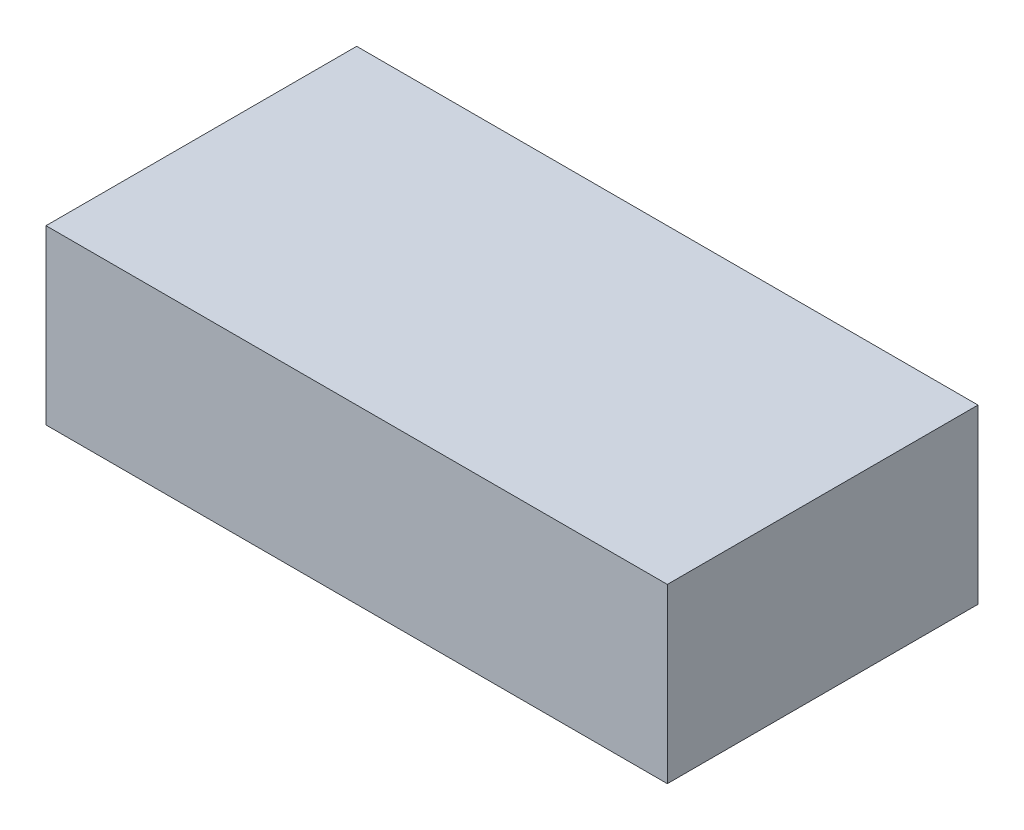
ISO-10303-21;
HEADER;
FILE_DESCRIPTION(('STEP AP214'),'2;1');
FILE_NAME('part.step','',(''),(''),'','','');
FILE_SCHEMA(('AUTOMOTIVE_DESIGN { 1 0 10303 214 1 1 1 1 }'));
ENDSEC;
DATA;
#1=APPLICATION_CONTEXT('core data for automotive mechanical design processes');
#2=APPLICATION_PROTOCOL_DEFINITION('international standard','automotive_design',2000,#1);
#3=PRODUCT_CONTEXT('',#1,'mechanical');
#4=PRODUCT('Part','Part','',(#3));
#5=PRODUCT_RELATED_PRODUCT_CATEGORY('part','',(#4));
#6=PRODUCT_DEFINITION_FORMATION('','',#4);
#7=PRODUCT_DEFINITION_CONTEXT('part definition',#1,'design');
#8=PRODUCT_DEFINITION('design','',#6,#7);
#9=PRODUCT_DEFINITION_SHAPE('','',#8);
#10=(LENGTH_UNIT() NAMED_UNIT(*) SI_UNIT(.MILLI.,.METRE.));
#11=(NAMED_UNIT(*) PLANE_ANGLE_UNIT() SI_UNIT($,.RADIAN.));
#12=(NAMED_UNIT(*) SI_UNIT($,.STERADIAN.) SOLID_ANGLE_UNIT());
#13=UNCERTAINTY_MEASURE_WITH_UNIT(LENGTH_MEASURE(1.E-05),#10,'distance_accuracy_value','');
#14=(GEOMETRIC_REPRESENTATION_CONTEXT(3) GLOBAL_UNCERTAINTY_ASSIGNED_CONTEXT((#13)) GLOBAL_UNIT_ASSIGNED_CONTEXT((#10,
#11,#12)) REPRESENTATION_CONTEXT('',''));
#15=CARTESIAN_POINT('',(0.,0.,0.));
#16=DIRECTION('',(0.,0.,1.));
#17=DIRECTION('',(1.,0.,0.));
#18=AXIS2_PLACEMENT_3D('',#15,#16,#17);
#19=CARTESIAN_POINT('',(-114.3,63.5,57.15));
#20=DIRECTION('',(-1.,0.,0.));
#21=DIRECTION('',(0.,0.,1.));
#22=AXIS2_PLACEMENT_3D('',#19,#20,#21);
#23=PLANE('',#22);
#24=CARTESIAN_POINT('',(-114.3,57.15,-38.1));
#25=DIRECTION('',(-1.,0.,0.));
#26=DIRECTION('',(0.,0.,1.));
#27=AXIS2_PLACEMENT_3D('',#24,#25,#26);
#28=CIRCLE('',#27,1.5875);
#29=CARTESIAN_POINT('',(-114.3,57.15,-36.5125));
#30=VERTEX_POINT('',#29);
#31=EDGE_CURVE('E145',#30,#30,#28,.T.);
#32=ORIENTED_EDGE('',*,*,#31,.F.);
#33=EDGE_LOOP('',(#32));
#34=FACE_BOUND('',#33,.T.);
#35=CARTESIAN_POINT('',(-114.3,57.15,38.1));
#36=DIRECTION('',(-1.,0.,0.));
#37=DIRECTION('',(0.,0.,1.));
#38=AXIS2_PLACEMENT_3D('',#35,#36,#37);
#39=CIRCLE('',#38,1.5875);
#40=CARTESIAN_POINT('',(-114.3,57.15,39.6875));
#41=VERTEX_POINT('',#40);
#42=EDGE_CURVE('E148',#41,#41,#39,.T.);
#43=ORIENTED_EDGE('',*,*,#42,.F.);
#44=EDGE_LOOP('',(#43));
#45=FACE_BOUND('',#44,.T.);
#46=DIRECTION('',(0.,0.,-1.));
#47=VECTOR('',#46,1.);
#48=CARTESIAN_POINT('',(-114.3,0.,57.15));
#49=LINE('',#48,#47);
#50=CARTESIAN_POINT('',(-114.3,0.,57.15));
#51=VERTEX_POINT('',#50);
#52=CARTESIAN_POINT('',(-114.3,0.,-57.15));
#53=VERTEX_POINT('',#52);
#54=EDGE_CURVE('E117',#51,#53,#49,.T.);
#55=ORIENTED_EDGE('',*,*,#54,.F.);
#56=DIRECTION('',(0.,-1.,0.));
#57=VECTOR('',#56,1.);
#58=CARTESIAN_POINT('',(-114.3,63.5,57.15));
#59=LINE('',#58,#57);
#60=CARTESIAN_POINT('',(-114.3,63.5,57.15));
#61=VERTEX_POINT('',#60);
#62=EDGE_CURVE('E11',#61,#51,#59,.T.);
#63=ORIENTED_EDGE('',*,*,#62,.F.);
#64=DIRECTION('',(0.,0.,-1.));
#65=VECTOR('',#64,1.);
#66=CARTESIAN_POINT('',(-114.3,63.5,57.15));
#67=LINE('',#66,#65);
#68=CARTESIAN_POINT('',(-114.3,63.5,-57.15));
#69=VERTEX_POINT('',#68);
#70=EDGE_CURVE('E109',#61,#69,#67,.T.);
#71=ORIENTED_EDGE('',*,*,#70,.T.);
#72=DIRECTION('',(0.,-1.,0.));
#73=VECTOR('',#72,1.);
#74=CARTESIAN_POINT('',(-114.3,63.5,-57.15));
#75=LINE('',#74,#73);
#76=EDGE_CURVE('E48',#69,#53,#75,.T.);
#77=ORIENTED_EDGE('',*,*,#76,.T.);
#78=EDGE_LOOP('',(#55,#63,#71,#77));
#79=FACE_BOUND('',#78,.T.);
#80=ADVANCED_FACE('F45',(#34,#45,#79),#23,.T.);
#81=CARTESIAN_POINT('',(-114.3,63.5,57.15));
#82=DIRECTION('',(0.,0.,-1.));
#83=DIRECTION('',(-1.,0.,0.));
#84=AXIS2_PLACEMENT_3D('',#81,#82,#83);
#85=PLANE('',#84);
#86=DIRECTION('',(1.,0.,0.));
#87=VECTOR('',#86,1.);
#88=CARTESIAN_POINT('',(-114.3,0.,57.15));
#89=LINE('',#88,#87);
#90=CARTESIAN_POINT('',(114.3,0.,57.15));
#91=VERTEX_POINT('',#90);
#92=EDGE_CURVE('E79',#51,#91,#89,.T.);
#93=ORIENTED_EDGE('',*,*,#92,.T.);
#94=DIRECTION('',(0.,-1.,0.));
#95=VECTOR('',#94,1.);
#96=CARTESIAN_POINT('',(114.3,63.5,57.15));
#97=LINE('',#96,#95);
#98=CARTESIAN_POINT('',(114.3,63.5,57.15));
#99=VERTEX_POINT('',#98);
#100=EDGE_CURVE('E55',#99,#91,#97,.T.);
#101=ORIENTED_EDGE('',*,*,#100,.F.);
#102=DIRECTION('',(1.,0.,0.));
#103=VECTOR('',#102,1.);
#104=CARTESIAN_POINT('',(-114.3,63.5,57.15));
#105=LINE('',#104,#103);
#106=EDGE_CURVE('E96',#61,#99,#105,.T.);
#107=ORIENTED_EDGE('',*,*,#106,.F.);
#108=ORIENTED_EDGE('',*,*,#62,.T.);
#109=EDGE_LOOP('',(#93,#101,#107,#108));
#110=FACE_BOUND('',#109,.T.);
#111=ADVANCED_FACE('F134',(#110),#85,.F.);
#112=CARTESIAN_POINT('',(114.3,63.5,57.15));
#113=DIRECTION('',(-1.,0.,0.));
#114=DIRECTION('',(0.,0.,1.));
#115=AXIS2_PLACEMENT_3D('',#112,#113,#114);
#116=PLANE('',#115);
#117=DIRECTION('',(0.,0.,-1.));
#118=VECTOR('',#117,1.);
#119=CARTESIAN_POINT('',(114.3,0.,57.15));
#120=LINE('',#119,#118);
#121=CARTESIAN_POINT('',(114.3,0.,-57.15));
#122=VERTEX_POINT('',#121);
#123=EDGE_CURVE('E104',#91,#122,#120,.T.);
#124=ORIENTED_EDGE('',*,*,#123,.T.);
#125=DIRECTION('',(0.,-1.,0.));
#126=VECTOR('',#125,1.);
#127=CARTESIAN_POINT('',(114.3,63.5,-57.15));
#128=LINE('',#127,#126);
#129=CARTESIAN_POINT('',(114.3,63.5,-57.15));
#130=VERTEX_POINT('',#129);
#131=EDGE_CURVE('E101',#130,#122,#128,.T.);
#132=ORIENTED_EDGE('',*,*,#131,.F.);
#133=DIRECTION('',(0.,0.,-1.));
#134=VECTOR('',#133,1.);
#135=CARTESIAN_POINT('',(114.3,63.5,57.15));
#136=LINE('',#135,#134);
#137=EDGE_CURVE('E91',#99,#130,#136,.T.);
#138=ORIENTED_EDGE('',*,*,#137,.F.);
#139=ORIENTED_EDGE('',*,*,#100,.T.);
#140=EDGE_LOOP('',(#124,#132,#138,#139));
#141=FACE_BOUND('',#140,.T.);
#142=ADVANCED_FACE('F102',(#141),#116,.F.);
#143=CARTESIAN_POINT('',(-114.3,63.5,-57.15));
#144=DIRECTION('',(0.,0.,-1.));
#145=DIRECTION('',(-1.,0.,0.));
#146=AXIS2_PLACEMENT_3D('',#143,#144,#145);
#147=PLANE('',#146);
#148=DIRECTION('',(1.,0.,0.));
#149=VECTOR('',#148,1.);
#150=CARTESIAN_POINT('',(-114.3,0.,-57.15));
#151=LINE('',#150,#149);
#152=EDGE_CURVE('E121',#53,#122,#151,.T.);
#153=ORIENTED_EDGE('',*,*,#152,.F.);
#154=ORIENTED_EDGE('',*,*,#76,.F.);
#155=DIRECTION('',(1.,0.,0.));
#156=VECTOR('',#155,1.);
#157=CARTESIAN_POINT('',(-114.3,63.5,-57.15));
#158=LINE('',#157,#156);
#159=EDGE_CURVE('E95',#69,#130,#158,.T.);
#160=ORIENTED_EDGE('',*,*,#159,.T.);
#161=ORIENTED_EDGE('',*,*,#131,.T.);
#162=EDGE_LOOP('',(#153,#154,#160,#161));
#163=FACE_BOUND('',#162,.T.);
#164=ADVANCED_FACE('F107',(#163),#147,.T.);
#165=CARTESIAN_POINT('',(0.,63.5,0.));
#166=DIRECTION('',(0.,-1.,0.));
#167=DIRECTION('',(0.,0.,-1.));
#168=AXIS2_PLACEMENT_3D('',#165,#166,#167);
#169=PLANE('',#168);
#170=ORIENTED_EDGE('',*,*,#70,.F.);
#171=ORIENTED_EDGE('',*,*,#106,.T.);
#172=ORIENTED_EDGE('',*,*,#137,.T.);
#173=ORIENTED_EDGE('',*,*,#159,.F.);
#174=EDGE_LOOP('',(#170,#171,#172,#173));
#175=FACE_BOUND('',#174,.T.);
#176=ADVANCED_FACE('F94',(#175),#169,.F.);
#177=CARTESIAN_POINT('',(0.,0.,0.));
#178=DIRECTION('',(0.,-1.,0.));
#179=DIRECTION('',(0.,0.,-1.));
#180=AXIS2_PLACEMENT_3D('',#177,#178,#179);
#181=PLANE('',#180);
#182=ORIENTED_EDGE('',*,*,#54,.T.);
#183=ORIENTED_EDGE('',*,*,#152,.T.);
#184=ORIENTED_EDGE('',*,*,#123,.F.);
#185=ORIENTED_EDGE('',*,*,#92,.F.);
#186=EDGE_LOOP('',(#182,#183,#184,#185));
#187=FACE_BOUND('',#186,.T.);
#188=ADVANCED_FACE('F131',(#187),#181,.T.);
#189=CARTESIAN_POINT('',(-107.95,57.15,38.1));
#190=DIRECTION('',(-1.,0.,0.));
#191=DIRECTION('',(0.,0.,1.));
#192=AXIS2_PLACEMENT_3D('',#189,#190,#191);
#193=CYLINDRICAL_SURFACE('',#192,1.5875);
#194=CARTESIAN_POINT('',(-107.95,57.15,38.1));
#195=DIRECTION('',(-1.,0.,0.));
#196=DIRECTION('',(0.,0.,1.));
#197=AXIS2_PLACEMENT_3D('',#194,#195,#196);
#198=CIRCLE('',#197,1.5875);
#199=CARTESIAN_POINT('',(-107.95,57.15,39.6875));
#200=VERTEX_POINT('',#199);
#201=EDGE_CURVE('E151',#200,#200,#198,.T.);
#202=ORIENTED_EDGE('',*,*,#201,.F.);
#203=EDGE_LOOP('',(#202));
#204=FACE_BOUND('',#203,.T.);
#205=ORIENTED_EDGE('',*,*,#42,.T.);
#206=EDGE_LOOP('',(#205));
#207=FACE_BOUND('',#206,.T.);
#208=ADVANCED_FACE('F174',(#204,#207),#193,.F.);
#209=CARTESIAN_POINT('',(-107.95,57.15,38.1));
#210=DIRECTION('',(-1.,0.,0.));
#211=DIRECTION('',(0.,0.,1.));
#212=AXIS2_PLACEMENT_3D('',#209,#210,#211);
#213=PLANE('',#212);
#214=ORIENTED_EDGE('',*,*,#201,.T.);
#215=EDGE_LOOP('',(#214));
#216=FACE_BOUND('',#215,.T.);
#217=ADVANCED_FACE('F167',(#216),#213,.T.);
#218=CARTESIAN_POINT('',(-107.95,57.15,-38.1));
#219=DIRECTION('',(-1.,0.,0.));
#220=DIRECTION('',(0.,0.,1.));
#221=AXIS2_PLACEMENT_3D('',#218,#219,#220);
#222=CYLINDRICAL_SURFACE('',#221,1.5875);
#223=CARTESIAN_POINT('',(-107.95,57.15,-38.1));
#224=DIRECTION('',(-1.,0.,0.));
#225=DIRECTION('',(0.,0.,1.));
#226=AXIS2_PLACEMENT_3D('',#223,#224,#225);
#227=CIRCLE('',#226,1.5875);
#228=CARTESIAN_POINT('',(-107.95,57.15,-36.5125));
#229=VERTEX_POINT('',#228);
#230=EDGE_CURVE('E122',#229,#229,#227,.T.);
#231=ORIENTED_EDGE('',*,*,#230,.F.);
#232=EDGE_LOOP('',(#231));
#233=FACE_BOUND('',#232,.T.);
#234=ORIENTED_EDGE('',*,*,#31,.T.);
#235=EDGE_LOOP('',(#234));
#236=FACE_BOUND('',#235,.T.);
#237=ADVANCED_FACE('F164',(#233,#236),#222,.F.);
#238=CARTESIAN_POINT('',(-107.95,57.15,-38.1));
#239=DIRECTION('',(-1.,0.,0.));
#240=DIRECTION('',(0.,0.,1.));
#241=AXIS2_PLACEMENT_3D('',#238,#239,#240);
#242=PLANE('',#241);
#243=ORIENTED_EDGE('',*,*,#230,.T.);
#244=EDGE_LOOP('',(#243));
#245=FACE_BOUND('',#244,.T.);
#246=ADVANCED_FACE('F162',(#245),#242,.T.);
#247=CLOSED_SHELL('',(#80,#111,#142,#164,#176,#188,#208,#217,#237,#246));
#248=MANIFOLD_SOLID_BREP('B2',#247);
#249=ADVANCED_BREP_SHAPE_REPRESENTATION('',(#18,#248),#14);
#250=SHAPE_DEFINITION_REPRESENTATION(#9,#249);
ENDSEC;
END-ISO-10303-21;
